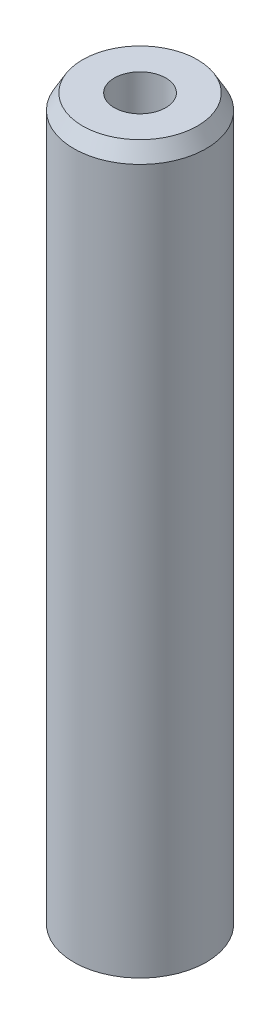
ISO-10303-21;
HEADER;
FILE_DESCRIPTION(('STEP AP214'),'2;1');
FILE_NAME('part.step','',(''),(''),'','','');
FILE_SCHEMA(('AUTOMOTIVE_DESIGN { 1 0 10303 214 1 1 1 1 }'));
ENDSEC;
DATA;
#1=APPLICATION_CONTEXT('core data for automotive mechanical design processes');
#2=APPLICATION_PROTOCOL_DEFINITION('international standard','automotive_design',2000,#1);
#3=PRODUCT_CONTEXT('',#1,'mechanical');
#4=PRODUCT('Part','Part','',(#3));
#5=PRODUCT_RELATED_PRODUCT_CATEGORY('part','',(#4));
#6=PRODUCT_DEFINITION_FORMATION('','',#4);
#7=PRODUCT_DEFINITION_CONTEXT('part definition',#1,'design');
#8=PRODUCT_DEFINITION('design','',#6,#7);
#9=PRODUCT_DEFINITION_SHAPE('','',#8);
#10=(LENGTH_UNIT() NAMED_UNIT(*) SI_UNIT(.MILLI.,.METRE.));
#11=(NAMED_UNIT(*) PLANE_ANGLE_UNIT() SI_UNIT($,.RADIAN.));
#12=(NAMED_UNIT(*) SI_UNIT($,.STERADIAN.) SOLID_ANGLE_UNIT());
#13=UNCERTAINTY_MEASURE_WITH_UNIT(LENGTH_MEASURE(1.E-05),#10,'distance_accuracy_value','');
#14=(GEOMETRIC_REPRESENTATION_CONTEXT(3) GLOBAL_UNCERTAINTY_ASSIGNED_CONTEXT((#13)) GLOBAL_UNIT_ASSIGNED_CONTEXT((#10,
#11,#12)) REPRESENTATION_CONTEXT('',''));
#15=CARTESIAN_POINT('',(0.,0.,0.));
#16=DIRECTION('',(0.,0.,1.));
#17=DIRECTION('',(1.,0.,0.));
#18=AXIS2_PLACEMENT_3D('',#15,#16,#17);
#19=CARTESIAN_POINT('',(0.,109.997766888092,0.));
#20=DIRECTION('',(0.,-1.,0.));
#21=DIRECTION('',(0.,0.,-1.));
#22=AXIS2_PLACEMENT_3D('',#19,#20,#21);
#23=CYLINDRICAL_SURFACE('',#22,10.);
#24=CARTESIAN_POINT('',(0.,107.700225339317,0.));
#25=DIRECTION('',(0.,1.,0.));
#26=DIRECTION('',(0.,0.,1.));
#27=AXIS2_PLACEMENT_3D('',#24,#25,#26);
#28=CIRCLE('',#27,10.);
#29=CARTESIAN_POINT('',(0.,107.700225339317,-10.));
#30=VERTEX_POINT('',#29);
#31=EDGE_CURVE('E50',#30,#30,#28,.F.);
#32=CARTESIAN_POINT('',(0.,1.32648623165982,0.));
#33=DIRECTION('',(0.,1.,0.));
#34=DIRECTION('',(0.,0.,1.));
#35=AXIS2_PLACEMENT_3D('',#32,#33,#34);
#36=CIRCLE('',#35,10.);
#37=CARTESIAN_POINT('',(0.,1.32648623165982,-10.));
#38=VERTEX_POINT('',#37);
#39=EDGE_CURVE('E51',#38,#38,#36,.T.);
#40=CARTESIAN_POINT('',(0.,107.700225339317,-10.));
#41=CARTESIAN_POINT('',(0.,106.592165556945,-10.));
#42=CARTESIAN_POINT('',(0.,105.484105774574,-10.));
#43=CARTESIAN_POINT('',(0.,103.267986209831,-10.));
#44=CARTESIAN_POINT('',(0.,102.15992642746,-10.));
#45=CARTESIAN_POINT('',(0.,99.9438068627167,-10.));
#46=CARTESIAN_POINT('',(0.,98.8357470803453,-10.));
#47=CARTESIAN_POINT('',(0.,96.6196275156024,-10.));
#48=CARTESIAN_POINT('',(0.,95.511567733231,-10.));
#49=CARTESIAN_POINT('',(0.,93.2954481684882,-10.));
#50=CARTESIAN_POINT('',(0.,92.1873883861168,-10.));
#51=CARTESIAN_POINT('',(0.,89.9712688213739,-10.));
#52=CARTESIAN_POINT('',(0.,88.8632090390025,-10.));
#53=CARTESIAN_POINT('',(0.,86.6470894742596,-10.));
#54=CARTESIAN_POINT('',(0.,85.5390296918882,-10.));
#55=CARTESIAN_POINT('',(0.,83.3229101271453,-10.));
#56=CARTESIAN_POINT('',(0.,82.2148503447739,-10.));
#57=CARTESIAN_POINT('',(0.,79.9987307800311,-10.));
#58=CARTESIAN_POINT('',(0.,78.8906709976596,-10.));
#59=CARTESIAN_POINT('',(0.,76.6745514329168,-10.));
#60=CARTESIAN_POINT('',(0.,75.5664916505454,-10.));
#61=CARTESIAN_POINT('',(0.,73.3503720858025,-10.));
#62=CARTESIAN_POINT('',(0.,72.2423123034311,-10.));
#63=CARTESIAN_POINT('',(0.,70.0261927386882,-10.));
#64=CARTESIAN_POINT('',(0.,68.9181329563168,-10.));
#65=CARTESIAN_POINT('',(0.,66.7020133915739,-10.));
#66=CARTESIAN_POINT('',(0.,65.5939536092025,-10.));
#67=CARTESIAN_POINT('',(0.,63.3778340444597,-10.));
#68=CARTESIAN_POINT('',(0.,62.2697742620882,-10.));
#69=CARTESIAN_POINT('',(0.,60.0536546973454,-10.));
#70=CARTESIAN_POINT('',(0.,58.945594914974,-10.));
#71=CARTESIAN_POINT('',(0.,56.7294753502311,-10.));
#72=CARTESIAN_POINT('',(0.,55.6214155678597,-10.));
#73=CARTESIAN_POINT('',(0.,53.4052960031168,-10.));
#74=CARTESIAN_POINT('',(0.,52.2972362207454,-10.));
#75=CARTESIAN_POINT('',(0.,50.0811166560025,-10.));
#76=CARTESIAN_POINT('',(0.,48.9730568736311,-10.));
#77=CARTESIAN_POINT('',(0.,46.7569373088883,-10.));
#78=CARTESIAN_POINT('',(0.,45.6488775265168,-10.));
#79=CARTESIAN_POINT('',(0.,43.432757961774,-10.));
#80=CARTESIAN_POINT('',(0.,42.3246981794026,-10.));
#81=CARTESIAN_POINT('',(0.,40.1085786146597,-10.));
#82=CARTESIAN_POINT('',(0.,39.0005188322883,-10.));
#83=CARTESIAN_POINT('',(0.,36.7843992675454,-10.));
#84=CARTESIAN_POINT('',(0.,35.676339485174,-10.));
#85=CARTESIAN_POINT('',(0.,33.4602199204312,-10.));
#86=CARTESIAN_POINT('',(0.,32.3521601380597,-10.));
#87=CARTESIAN_POINT('',(0.,30.1360405733169,-10.));
#88=CARTESIAN_POINT('',(0.,29.0279807909455,-10.));
#89=CARTESIAN_POINT('',(0.,26.8118612262026,-10.));
#90=CARTESIAN_POINT('',(0.,25.7038014438312,-10.));
#91=CARTESIAN_POINT('',(0.,23.4876818790883,-10.));
#92=CARTESIAN_POINT('',(0.,22.3796220967169,-10.));
#93=CARTESIAN_POINT('',(0.,20.1635025319741,-10.));
#94=CARTESIAN_POINT('',(0.,19.0554427496026,-10.));
#95=CARTESIAN_POINT('',(0.,16.8393231848598,-10.));
#96=CARTESIAN_POINT('',(0.,15.7312634024884,-10.));
#97=CARTESIAN_POINT('',(0.,13.5151438377455,-10.));
#98=CARTESIAN_POINT('',(0.,12.4070840553741,-10.));
#99=CARTESIAN_POINT('',(0.,10.1909644906312,-10.));
#100=CARTESIAN_POINT('',(0.,9.08290470825979,-10.));
#101=CARTESIAN_POINT('',(0.,6.86678514351694,-10.));
#102=CARTESIAN_POINT('',(0.,5.75872536114551,-10.));
#103=CARTESIAN_POINT('',(0.,3.54260579640266,-10.));
#104=CARTESIAN_POINT('',(0.,2.43454601403124,-10.));
#105=CARTESIAN_POINT('',(0.,1.32648623165982,-10.));
#106=B_SPLINE_CURVE_WITH_KNOTS('',3,(#40,#41,#42,#43,#44,#45,#46,#47,#48,#49,#50,#51,#52,#53,
#54,#55,#56,#57,#58,#59,#60,#61,#62,#63,#64,#65,#66,#67,#68,#69,#70,#71,#72,#73,#74,#75,#76,#77,
#78,#79,#80,#81,#82,#83,#84,#85,#86,#87,#88,#89,#90,#91,#92,#93,#94,#95,#96,#97,#98,#99,#100,
#101,#102,#103,#104,#105),.UNSPECIFIED.,.F.,.F.,(4,2,2,2,2,2,2,2,2,2,2,2,2,2,2,2,2,2,2,2,2,2,2,
2,2,2,2,2,2,2,2,2,4),(0.,3.32417934711428,6.64835869422856,9.97253804134284,13.2967173884571,
16.6208967355714,19.9450760826857,23.2692554297999,26.5934347769142,29.9176141240285,
33.2417934711428,36.5659728182571,39.8901521653713,43.2143315124856,46.5385108595999,
49.8626902067142,53.1868695538285,56.5110489009427,59.835228248057,63.1594075951713,
66.4835869422856,69.8077662893999,73.1319456365141,76.4561249836284,79.7803043307427,
83.104483677857,86.4286630249712,89.7528423720855,93.0770217191998,96.4012010663141,
99.7253804134283,103.049559760543,106.373739107657),.UNSPECIFIED.);
#107=EDGE_CURVE('BSEAM39',#30,#38,#106,.T.);
#108=ORIENTED_EDGE('',*,*,#31,.T.);
#109=ORIENTED_EDGE('',*,*,#39,.T.);
#110=ORIENTED_EDGE('',*,*,#107,.T.);
#111=ORIENTED_EDGE('',*,*,#107,.F.);
#112=EDGE_LOOP('',(#108,#110,#109,#111));
#113=FACE_BOUND('',#112,.T.);
#114=ADVANCED_FACE('F39',(#113),#23,.T.);
#115=CARTESIAN_POINT('',(0.,109.997766888092,0.));
#116=DIRECTION('',(0.,1.,0.));
#117=DIRECTION('',(0.,0.,1.));
#118=AXIS2_PLACEMENT_3D('',#115,#116,#117);
#119=PLANE('',#118);
#120=CARTESIAN_POINT('',(0.,109.997766888092,0.));
#121=DIRECTION('',(0.,1.,0.));
#122=DIRECTION('',(0.,0.,1.));
#123=AXIS2_PLACEMENT_3D('',#120,#121,#122);
#124=CIRCLE('',#123,8.67351376834025);
#125=CARTESIAN_POINT('',(0.,109.997766888092,8.67351376834025));
#126=VERTEX_POINT('',#125);
#127=EDGE_CURVE('E54',#126,#126,#124,.T.);
#128=ORIENTED_EDGE('',*,*,#127,.T.);
#129=EDGE_LOOP('',(#128));
#130=FACE_BOUND('',#129,.T.);
#131=CARTESIAN_POINT('',(0.,109.997766888092,0.));
#132=DIRECTION('',(0.,1.,0.));
#133=DIRECTION('',(0.,0.,1.));
#134=AXIS2_PLACEMENT_3D('',#131,#132,#133);
#135=CIRCLE('',#134,3.8888135683063);
#136=CARTESIAN_POINT('',(0.,109.997766888092,-3.8888135683063));
#137=VERTEX_POINT('',#136);
#138=EDGE_CURVE('E58',#137,#137,#135,.T.);
#139=ORIENTED_EDGE('',*,*,#138,.F.);
#140=EDGE_LOOP('',(#139));
#141=FACE_BOUND('',#140,.T.);
#142=ADVANCED_FACE('F69',(#130,#141),#119,.T.);
#143=CARTESIAN_POINT('',(0.,0.,0.));
#144=DIRECTION('',(0.,1.,0.));
#145=DIRECTION('',(0.,0.,1.));
#146=AXIS2_PLACEMENT_3D('',#143,#144,#145);
#147=PLANE('',#146);
#148=CARTESIAN_POINT('',(0.,0.,0.));
#149=DIRECTION('',(0.,1.,0.));
#150=DIRECTION('',(0.,0.,1.));
#151=AXIS2_PLACEMENT_3D('',#148,#149,#150);
#152=CIRCLE('',#151,7.70245845122459);
#153=CARTESIAN_POINT('',(0.,0.,7.70245845122459));
#154=VERTEX_POINT('',#153);
#155=EDGE_CURVE('E10',#154,#154,#152,.F.);
#156=ORIENTED_EDGE('',*,*,#155,.T.);
#157=EDGE_LOOP('',(#156));
#158=FACE_BOUND('',#157,.T.);
#159=CARTESIAN_POINT('',(0.,0.,0.));
#160=DIRECTION('',(0.,1.,0.));
#161=DIRECTION('',(0.,0.,1.));
#162=AXIS2_PLACEMENT_3D('',#159,#160,#161);
#163=CIRCLE('',#162,3.8888135683063);
#164=CARTESIAN_POINT('',(0.,0.,-3.8888135683063));
#165=VERTEX_POINT('',#164);
#166=EDGE_CURVE('E63',#165,#165,#163,.T.);
#167=ORIENTED_EDGE('',*,*,#166,.T.);
#168=EDGE_LOOP('',(#167));
#169=FACE_BOUND('',#168,.T.);
#170=ADVANCED_FACE('F75',(#158,#169),#147,.F.);
#171=CARTESIAN_POINT('',(0.,109.997766888092,0.));
#172=DIRECTION('',(0.,-1.,0.));
#173=DIRECTION('',(0.,0.,-1.));
#174=AXIS2_PLACEMENT_3D('',#171,#172,#173);
#175=CYLINDRICAL_SURFACE('',#174,3.8888135683063);
#176=CARTESIAN_POINT('',(0.,109.997766888092,-3.8888135683063));
#177=CARTESIAN_POINT('',(0.,108.851956816341,-3.8888135683063));
#178=CARTESIAN_POINT('',(0.,107.70614674459,-3.8888135683063));
#179=CARTESIAN_POINT('',(0.,105.414526601088,-3.8888135683063));
#180=CARTESIAN_POINT('',(0.,104.268716529337,-3.8888135683063));
#181=CARTESIAN_POINT('',(0.,101.977096385835,-3.8888135683063));
#182=CARTESIAN_POINT('',(0.,100.831286314084,-3.8888135683063));
#183=CARTESIAN_POINT('',(0.,98.5396661705824,-3.8888135683063));
#184=CARTESIAN_POINT('',(0.,97.3938560988315,-3.8888135683063));
#185=CARTESIAN_POINT('',(0.,95.1022359553295,-3.8888135683063));
#186=CARTESIAN_POINT('',(0.,93.9564258835786,-3.8888135683063));
#187=CARTESIAN_POINT('',(0.,91.6648057400767,-3.8888135683063));
#188=CARTESIAN_POINT('',(0.,90.5189956683257,-3.8888135683063));
#189=CARTESIAN_POINT('',(0.,88.2273755248238,-3.8888135683063));
#190=CARTESIAN_POINT('',(0.,87.0815654530728,-3.8888135683063));
#191=CARTESIAN_POINT('',(0.,84.7899453095709,-3.8888135683063));
#192=CARTESIAN_POINT('',(0.,83.64413523782,-3.8888135683063));
#193=CARTESIAN_POINT('',(0.,81.352515094318,-3.8888135683063));
#194=CARTESIAN_POINT('',(0.,80.2067050225671,-3.8888135683063));
#195=CARTESIAN_POINT('',(0.,77.9150848790652,-3.8888135683063));
#196=CARTESIAN_POINT('',(0.,76.7692748073142,-3.8888135683063));
#197=CARTESIAN_POINT('',(0.,74.4776546638123,-3.8888135683063));
#198=CARTESIAN_POINT('',(0.,73.3318445920613,-3.8888135683063));
#199=CARTESIAN_POINT('',(0.,71.0402244485594,-3.8888135683063));
#200=CARTESIAN_POINT('',(0.,69.8944143768084,-3.8888135683063));
#201=CARTESIAN_POINT('',(0.,67.6027942333065,-3.8888135683063));
#202=CARTESIAN_POINT('',(0.,66.4569841615556,-3.8888135683063));
#203=CARTESIAN_POINT('',(0.,64.1653640180537,-3.8888135683063));
#204=CARTESIAN_POINT('',(0.,63.0195539463027,-3.8888135683063));
#205=CARTESIAN_POINT('',(0.,60.7279338028008,-3.8888135683063));
#206=CARTESIAN_POINT('',(0.,59.5821237310498,-3.8888135683063));
#207=CARTESIAN_POINT('',(0.,57.2905035875479,-3.8888135683063));
#208=CARTESIAN_POINT('',(0.,56.144693515797,-3.8888135683063));
#209=CARTESIAN_POINT('',(0.,53.853073372295,-3.8888135683063));
#210=CARTESIAN_POINT('',(0.,52.7072633005441,-3.8888135683063));
#211=CARTESIAN_POINT('',(0.,50.4156431570422,-3.8888135683063));
#212=CARTESIAN_POINT('',(0.,49.2698330852912,-3.8888135683063));
#213=CARTESIAN_POINT('',(0.,46.9782129417893,-3.8888135683063));
#214=CARTESIAN_POINT('',(0.,45.8324028700383,-3.8888135683063));
#215=CARTESIAN_POINT('',(0.,43.5407827265364,-3.8888135683063));
#216=CARTESIAN_POINT('',(0.,42.3949726547855,-3.8888135683063));
#217=CARTESIAN_POINT('',(0.,40.1033525112835,-3.8888135683063));
#218=CARTESIAN_POINT('',(0.,38.9575424395326,-3.8888135683063));
#219=CARTESIAN_POINT('',(0.,36.6659222960307,-3.8888135683063));
#220=CARTESIAN_POINT('',(0.,35.5201122242797,-3.8888135683063));
#221=CARTESIAN_POINT('',(0.,33.2284920807778,-3.8888135683063));
#222=CARTESIAN_POINT('',(0.,32.0826820090268,-3.8888135683063));
#223=CARTESIAN_POINT('',(0.,29.7910618655249,-3.8888135683063));
#224=CARTESIAN_POINT('',(0.,28.645251793774,-3.8888135683063));
#225=CARTESIAN_POINT('',(0.,26.353631650272,-3.8888135683063));
#226=CARTESIAN_POINT('',(0.,25.2078215785211,-3.8888135683063));
#227=CARTESIAN_POINT('',(0.,22.9162014350192,-3.8888135683063));
#228=CARTESIAN_POINT('',(0.,21.7703913632682,-3.8888135683063));
#229=CARTESIAN_POINT('',(0.,19.4787712197663,-3.8888135683063));
#230=CARTESIAN_POINT('',(0.,18.3329611480153,-3.8888135683063));
#231=CARTESIAN_POINT('',(0.,16.0413410045134,-3.8888135683063));
#232=CARTESIAN_POINT('',(0.,14.8955309327625,-3.8888135683063));
#233=CARTESIAN_POINT('',(0.,12.6039107892605,-3.8888135683063));
#234=CARTESIAN_POINT('',(0.,11.4581007175096,-3.8888135683063));
#235=CARTESIAN_POINT('',(0.,9.16648057400767,-3.8888135683063));
#236=CARTESIAN_POINT('',(0.,8.02067050225671,-3.8888135683063));
#237=CARTESIAN_POINT('',(0.,5.72905035875479,-3.8888135683063));
#238=CARTESIAN_POINT('',(0.,4.58324028700383,-3.8888135683063));
#239=CARTESIAN_POINT('',(0.,2.29162014350192,-3.8888135683063));
#240=CARTESIAN_POINT('',(0.,1.14581007175096,-3.8888135683063));
#241=CARTESIAN_POINT('',(0.,0.,-3.8888135683063));
#242=B_SPLINE_CURVE_WITH_KNOTS('',3,(#176,#177,#178,#179,#180,#181,#182,#183,#184,#185,#186,
#187,#188,#189,#190,#191,#192,#193,#194,#195,#196,#197,#198,#199,#200,#201,#202,#203,#204,#205,
#206,#207,#208,#209,#210,#211,#212,#213,#214,#215,#216,#217,#218,#219,#220,#221,#222,#223,#224,
#225,#226,#227,#228,#229,#230,#231,#232,#233,#234,#235,#236,#237,#238,#239,#240,#241),
.UNSPECIFIED.,.F.,.F.,(4,2,2,2,2,2,2,2,2,2,2,2,2,2,2,2,2,2,2,2,2,2,2,2,2,2,2,2,2,2,2,2,4),(0.,
3.43743021525288,6.87486043050575,10.3122906457586,13.7497208610115,17.1871510762644,
20.6245812915173,24.0620115067701,27.499441722023,30.9368719372759,34.3743021525287,
37.8117323677816,41.2491625830345,44.6865927982874,48.1240230135403,51.5614532287931,
54.998883444046,58.4363136592989,61.8737438745518,65.3111740898046,68.7486043050575,
72.1860345203104,75.6234647355632,79.0608949508161,82.498325166069,85.9357553813219,
89.3731855965747,92.8106158118276,96.2480460270805,99.6854762423334,103.122906457586,
106.560336672839,109.997766888092),.UNSPECIFIED.);
#243=EDGE_CURVE('BSEAM70',#137,#165,#242,.T.);
#244=ORIENTED_EDGE('',*,*,#138,.T.);
#245=ORIENTED_EDGE('',*,*,#166,.F.);
#246=ORIENTED_EDGE('',*,*,#243,.T.);
#247=ORIENTED_EDGE('',*,*,#243,.F.);
#248=EDGE_LOOP('',(#244,#246,#245,#247));
#249=FACE_BOUND('',#248,.T.);
#250=ADVANCED_FACE('F70',(#249),#175,.F.);
#251=CARTESIAN_POINT('',(0.,109.997766888092,0.));
#252=DIRECTION('',(0.,-1.,0.));
#253=DIRECTION('',(0.,0.,-1.));
#254=AXIS2_PLACEMENT_3D('',#251,#252,#253);
#255=CONICAL_SURFACE('',#254,8.67351376834025,0.523598775598296);
#256=ORIENTED_EDGE('',*,*,#31,.F.);
#257=EDGE_LOOP('',(#256));
#258=FACE_BOUND('',#257,.T.);
#259=ORIENTED_EDGE('',*,*,#127,.F.);
#260=EDGE_LOOP('',(#259));
#261=FACE_BOUND('',#260,.T.);
#262=ADVANCED_FACE('F81',(#258,#261),#255,.T.);
#263=CARTESIAN_POINT('',(0.,1.32648623165982,0.));
#264=DIRECTION('',(0.,1.,0.));
#265=DIRECTION('',(0.,0.,1.));
#266=AXIS2_PLACEMENT_3D('',#263,#264,#265);
#267=CONICAL_SURFACE('',#266,10.,1.0471975511966);
#268=ORIENTED_EDGE('',*,*,#155,.F.);
#269=EDGE_LOOP('',(#268));
#270=FACE_BOUND('',#269,.T.);
#271=ORIENTED_EDGE('',*,*,#39,.F.);
#272=EDGE_LOOP('',(#271));
#273=FACE_BOUND('',#272,.T.);
#274=ADVANCED_FACE('F45',(#270,#273),#267,.T.);
#275=CLOSED_SHELL('',(#114,#142,#170,#250,#262,#274));
#276=MANIFOLD_SOLID_BREP('B2',#275);
#277=ADVANCED_BREP_SHAPE_REPRESENTATION('',(#18,#276),#14);
#278=SHAPE_DEFINITION_REPRESENTATION(#9,#277);
ENDSEC;
END-ISO-10303-21;
